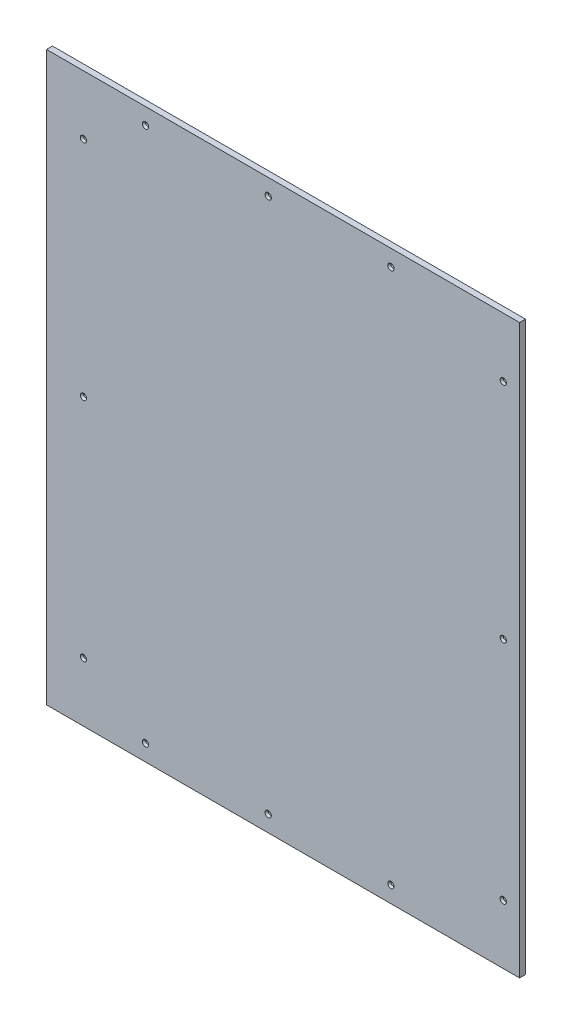
ISO-10303-21;
HEADER;
FILE_DESCRIPTION(('STEP AP214'),'2;1');
FILE_NAME('part.step','',(''),(''),'','','');
FILE_SCHEMA(('AUTOMOTIVE_DESIGN { 1 0 10303 214 1 1 1 1 }'));
ENDSEC;
DATA;
#1=APPLICATION_CONTEXT('core data for automotive mechanical design processes');
#2=APPLICATION_PROTOCOL_DEFINITION('international standard','automotive_design',2000,#1);
#3=PRODUCT_CONTEXT('',#1,'mechanical');
#4=PRODUCT('Part','Part','',(#3));
#5=PRODUCT_RELATED_PRODUCT_CATEGORY('part','',(#4));
#6=PRODUCT_DEFINITION_FORMATION('','',#4);
#7=PRODUCT_DEFINITION_CONTEXT('part definition',#1,'design');
#8=PRODUCT_DEFINITION('design','',#6,#7);
#9=PRODUCT_DEFINITION_SHAPE('','',#8);
#10=(LENGTH_UNIT() NAMED_UNIT(*) SI_UNIT(.MILLI.,.METRE.));
#11=(NAMED_UNIT(*) PLANE_ANGLE_UNIT() SI_UNIT($,.RADIAN.));
#12=(NAMED_UNIT(*) SI_UNIT($,.STERADIAN.) SOLID_ANGLE_UNIT());
#13=UNCERTAINTY_MEASURE_WITH_UNIT(LENGTH_MEASURE(1.E-05),#10,'distance_accuracy_value','');
#14=(GEOMETRIC_REPRESENTATION_CONTEXT(3) GLOBAL_UNCERTAINTY_ASSIGNED_CONTEXT((#13)) GLOBAL_UNIT_ASSIGNED_CONTEXT((#10,
#11,#12)) REPRESENTATION_CONTEXT('',''));
#15=CARTESIAN_POINT('',(0.,0.,0.));
#16=DIRECTION('',(0.,0.,1.));
#17=DIRECTION('',(1.,0.,0.));
#18=AXIS2_PLACEMENT_3D('',#15,#16,#17);
#19=CARTESIAN_POINT('',(0.,0.,12.7));
#20=DIRECTION('',(0.,0.,-1.));
#21=DIRECTION('',(-1.,0.,0.));
#22=AXIS2_PLACEMENT_3D('',#19,#20,#21);
#23=PLANE('',#22);
#24=CARTESIAN_POINT('',(-646.165814816772,1184.275,12.7));
#25=DIRECTION('',(0.,0.,1.));
#26=DIRECTION('',(1.,0.,0.));
#27=AXIS2_PLACEMENT_3D('',#24,#25,#26);
#28=CIRCLE('',#27,6.74370000000002);
#29=CARTESIAN_POINT('',(-639.422114816772,1184.275,12.7));
#30=VERTEX_POINT('',#29);
#31=EDGE_CURVE('E212',#30,#30,#28,.T.);
#32=ORIENTED_EDGE('',*,*,#31,.F.);
#33=EDGE_LOOP('',(#32));
#34=FACE_BOUND('',#33,.T.);
#35=CARTESIAN_POINT('',(-382.640814816772,1184.275,12.7));
#36=DIRECTION('',(0.,0.,1.));
#37=DIRECTION('',(1.,0.,0.));
#38=AXIS2_PLACEMENT_3D('',#35,#36,#37);
#39=CIRCLE('',#38,6.74370000000002);
#40=CARTESIAN_POINT('',(-375.897114816772,1184.275,12.7));
#41=VERTEX_POINT('',#40);
#42=EDGE_CURVE('E203',#41,#41,#39,.T.);
#43=ORIENTED_EDGE('',*,*,#42,.F.);
#44=EDGE_LOOP('',(#43));
#45=FACE_BOUND('',#44,.T.);
#46=CARTESIAN_POINT('',(-1042.91401418367,612.774999999999,12.7));
#47=DIRECTION('',(0.,0.,1.));
#48=DIRECTION('',(1.,0.,0.));
#49=AXIS2_PLACEMENT_3D('',#46,#47,#48);
#50=CIRCLE('',#49,6.74369999999991);
#51=CARTESIAN_POINT('',(-1036.17031418367,612.774999999999,12.7));
#52=VERTEX_POINT('',#51);
#53=EDGE_CURVE('E131',#52,#52,#50,.T.);
#54=ORIENTED_EDGE('',*,*,#53,.F.);
#55=EDGE_LOOP('',(#54));
#56=FACE_BOUND('',#55,.T.);
#57=DIRECTION('',(0.,1.,0.));
#58=VECTOR('',#57,1.);
#59=CARTESIAN_POINT('',(-106.288814816772,1219.2,12.7));
#60=LINE('',#59,#58);
#61=CARTESIAN_POINT('',(-106.288814816772,0.,12.7));
#62=VERTEX_POINT('',#61);
#63=CARTESIAN_POINT('',(-106.288814816772,1219.2,12.7));
#64=VERTEX_POINT('',#63);
#65=EDGE_CURVE('E90',#62,#64,#60,.T.);
#66=ORIENTED_EDGE('',*,*,#65,.T.);
#67=DIRECTION('',(-1.,0.,0.));
#68=VECTOR('',#67,1.);
#69=CARTESIAN_POINT('',(-106.288814816772,1219.2,12.7));
#70=LINE('',#69,#68);
#71=CARTESIAN_POINT('',(-1122.28881481677,1219.2,12.7));
#72=VERTEX_POINT('',#71);
#73=EDGE_CURVE('E85',#64,#72,#70,.T.);
#74=ORIENTED_EDGE('',*,*,#73,.T.);
#75=DIRECTION('',(0.,-1.,0.));
#76=VECTOR('',#75,1.);
#77=CARTESIAN_POINT('',(-1122.28881481677,1219.2,12.7));
#78=LINE('',#77,#76);
#79=CARTESIAN_POINT('',(-1122.28881481677,-2.22044604925031E-13,12.7));
#80=VERTEX_POINT('',#79);
#81=EDGE_CURVE('E88',#72,#80,#78,.T.);
#82=ORIENTED_EDGE('',*,*,#81,.T.);
#83=DIRECTION('',(1.,0.,0.));
#84=VECTOR('',#83,1.);
#85=CARTESIAN_POINT('',(-106.288814816772,0.,12.7));
#86=LINE('',#85,#84);
#87=EDGE_CURVE('E55',#80,#62,#86,.T.);
#88=ORIENTED_EDGE('',*,*,#87,.T.);
#89=EDGE_LOOP('',(#66,#74,#82,#88));
#90=FACE_BOUND('',#89,.T.);
#91=CARTESIAN_POINT('',(-1042.91401418367,1092.07299999998,12.7));
#92=DIRECTION('',(0.,0.,1.));
#93=DIRECTION('',(1.,0.,0.));
#94=AXIS2_PLACEMENT_3D('',#91,#92,#93);
#95=CIRCLE('',#94,6.74369999999991);
#96=CARTESIAN_POINT('',(-1036.17031418367,1092.07299999998,12.7));
#97=VERTEX_POINT('',#96);
#98=EDGE_CURVE('E122',#97,#97,#95,.T.);
#99=ORIENTED_EDGE('',*,*,#98,.F.);
#100=EDGE_LOOP('',(#99));
#101=FACE_BOUND('',#100,.T.);
#102=CARTESIAN_POINT('',(-1042.91401418364,126.999999999979,12.7));
#103=DIRECTION('',(0.,0.,1.));
#104=DIRECTION('',(1.,0.,0.));
#105=AXIS2_PLACEMENT_3D('',#102,#103,#104);
#106=CIRCLE('',#105,6.74369999999991);
#107=CARTESIAN_POINT('',(-1036.17031418364,126.999999999979,12.7));
#108=VERTEX_POINT('',#107);
#109=EDGE_CURVE('E140',#108,#108,#106,.T.);
#110=ORIENTED_EDGE('',*,*,#109,.F.);
#111=EDGE_LOOP('',(#110));
#112=FACE_BOUND('',#111,.T.);
#113=CARTESIAN_POINT('',(-909.690814816772,34.9249999999996,12.7));
#114=DIRECTION('',(0.,0.,1.));
#115=DIRECTION('',(1.,0.,0.));
#116=AXIS2_PLACEMENT_3D('',#113,#114,#115);
#117=CIRCLE('',#116,6.74370000000002);
#118=CARTESIAN_POINT('',(-902.947114816772,34.9249999999996,12.7));
#119=VERTEX_POINT('',#118);
#120=EDGE_CURVE('E149',#119,#119,#117,.T.);
#121=ORIENTED_EDGE('',*,*,#120,.F.);
#122=EDGE_LOOP('',(#121));
#123=FACE_BOUND('',#122,.T.);
#124=CARTESIAN_POINT('',(-646.165814816772,34.9249999999994,12.7));
#125=DIRECTION('',(0.,0.,1.));
#126=DIRECTION('',(1.,0.,0.));
#127=AXIS2_PLACEMENT_3D('',#124,#125,#126);
#128=CIRCLE('',#127,6.74370000000002);
#129=CARTESIAN_POINT('',(-639.422114816772,34.9249999999994,12.7));
#130=VERTEX_POINT('',#129);
#131=EDGE_CURVE('E158',#130,#130,#128,.T.);
#132=ORIENTED_EDGE('',*,*,#131,.F.);
#133=EDGE_LOOP('',(#132));
#134=FACE_BOUND('',#133,.T.);
#135=CARTESIAN_POINT('',(-382.640814816772,34.9249999999994,12.7));
#136=DIRECTION('',(0.,0.,1.));
#137=DIRECTION('',(1.,0.,0.));
#138=AXIS2_PLACEMENT_3D('',#135,#136,#137);
#139=CIRCLE('',#138,6.74370000000002);
#140=CARTESIAN_POINT('',(-375.897114816772,34.9249999999994,12.7));
#141=VERTEX_POINT('',#140);
#142=EDGE_CURVE('E167',#141,#141,#139,.T.);
#143=ORIENTED_EDGE('',*,*,#142,.F.);
#144=EDGE_LOOP('',(#143));
#145=FACE_BOUND('',#144,.T.);
#146=CARTESIAN_POINT('',(-141.213814816796,127.126999999999,12.7));
#147=DIRECTION('',(0.,0.,1.));
#148=DIRECTION('',(1.,0.,0.));
#149=AXIS2_PLACEMENT_3D('',#146,#147,#148);
#150=CIRCLE('',#149,6.74369999999999);
#151=CARTESIAN_POINT('',(-134.470114816796,127.126999999999,12.7));
#152=VERTEX_POINT('',#151);
#153=EDGE_CURVE('E176',#152,#152,#150,.T.);
#154=ORIENTED_EDGE('',*,*,#153,.F.);
#155=EDGE_LOOP('',(#154));
#156=FACE_BOUND('',#155,.T.);
#157=CARTESIAN_POINT('',(-141.213814816791,612.775,12.7));
#158=DIRECTION('',(0.,0.,1.));
#159=DIRECTION('',(1.,0.,0.));
#160=AXIS2_PLACEMENT_3D('',#157,#158,#159);
#161=CIRCLE('',#160,6.74369999999999);
#162=CARTESIAN_POINT('',(-134.470114816791,612.775,12.7));
#163=VERTEX_POINT('',#162);
#164=EDGE_CURVE('E185',#163,#163,#161,.T.);
#165=ORIENTED_EDGE('',*,*,#164,.F.);
#166=EDGE_LOOP('',(#165));
#167=FACE_BOUND('',#166,.T.);
#168=CARTESIAN_POINT('',(-141.213814816826,1092.073,12.7));
#169=DIRECTION('',(0.,0.,1.));
#170=DIRECTION('',(1.,0.,0.));
#171=AXIS2_PLACEMENT_3D('',#168,#169,#170);
#172=CIRCLE('',#171,6.74369999999999);
#173=CARTESIAN_POINT('',(-134.470114816826,1092.073,12.7));
#174=VERTEX_POINT('',#173);
#175=EDGE_CURVE('E194',#174,#174,#172,.T.);
#176=ORIENTED_EDGE('',*,*,#175,.F.);
#177=EDGE_LOOP('',(#176));
#178=FACE_BOUND('',#177,.T.);
#179=CARTESIAN_POINT('',(-909.690814816772,1184.275,12.7));
#180=DIRECTION('',(0.,0.,1.));
#181=DIRECTION('',(1.,0.,0.));
#182=AXIS2_PLACEMENT_3D('',#179,#180,#181);
#183=CIRCLE('',#182,6.74370000000002);
#184=CARTESIAN_POINT('',(-902.947114816772,1184.275,12.7));
#185=VERTEX_POINT('',#184);
#186=EDGE_CURVE('E221',#185,#185,#183,.T.);
#187=ORIENTED_EDGE('',*,*,#186,.F.);
#188=EDGE_LOOP('',(#187));
#189=FACE_BOUND('',#188,.T.);
#190=ADVANCED_FACE('F38',(#34,#45,#56,#90,#101,#112,#123,#134,#145,#156,#167,#178,#189),#23,.F.);
#191=CARTESIAN_POINT('',(0.,0.,0.));
#192=DIRECTION('',(0.,0.,-1.));
#193=DIRECTION('',(-1.,0.,0.));
#194=AXIS2_PLACEMENT_3D('',#191,#192,#193);
#195=PLANE('',#194);
#196=CARTESIAN_POINT('',(-646.165814816772,1184.275,0.));
#197=DIRECTION('',(0.,0.,1.));
#198=DIRECTION('',(1.,0.,0.));
#199=AXIS2_PLACEMENT_3D('',#196,#197,#198);
#200=CIRCLE('',#199,3.3782);
#201=CARTESIAN_POINT('',(-642.787614816772,1184.275,0.));
#202=VERTEX_POINT('',#201);
#203=EDGE_CURVE('E206',#202,#202,#200,.T.);
#204=ORIENTED_EDGE('',*,*,#203,.T.);
#205=EDGE_LOOP('',(#204));
#206=FACE_BOUND('',#205,.T.);
#207=CARTESIAN_POINT('',(-141.213814816826,1092.073,0.));
#208=DIRECTION('',(0.,0.,1.));
#209=DIRECTION('',(1.,0.,0.));
#210=AXIS2_PLACEMENT_3D('',#207,#208,#209);
#211=CIRCLE('',#210,3.3782);
#212=CARTESIAN_POINT('',(-137.835614816826,1092.073,0.));
#213=VERTEX_POINT('',#212);
#214=EDGE_CURVE('E188',#213,#213,#211,.T.);
#215=ORIENTED_EDGE('',*,*,#214,.T.);
#216=EDGE_LOOP('',(#215));
#217=FACE_BOUND('',#216,.T.);
#218=CARTESIAN_POINT('',(-141.213814816796,127.126999999999,0.));
#219=DIRECTION('',(0.,0.,1.));
#220=DIRECTION('',(1.,0.,0.));
#221=AXIS2_PLACEMENT_3D('',#218,#219,#220);
#222=CIRCLE('',#221,3.3782);
#223=CARTESIAN_POINT('',(-137.835614816796,127.126999999999,0.));
#224=VERTEX_POINT('',#223);
#225=EDGE_CURVE('E170',#224,#224,#222,.T.);
#226=ORIENTED_EDGE('',*,*,#225,.T.);
#227=EDGE_LOOP('',(#226));
#228=FACE_BOUND('',#227,.T.);
#229=CARTESIAN_POINT('',(-382.640814816772,34.9249999999994,0.));
#230=DIRECTION('',(0.,0.,1.));
#231=DIRECTION('',(1.,0.,0.));
#232=AXIS2_PLACEMENT_3D('',#229,#230,#231);
#233=CIRCLE('',#232,3.3782);
#234=CARTESIAN_POINT('',(-379.262614816772,34.9249999999994,0.));
#235=VERTEX_POINT('',#234);
#236=EDGE_CURVE('E161',#235,#235,#233,.T.);
#237=ORIENTED_EDGE('',*,*,#236,.T.);
#238=EDGE_LOOP('',(#237));
#239=FACE_BOUND('',#238,.T.);
#240=CARTESIAN_POINT('',(-646.165814816772,34.9249999999994,0.));
#241=DIRECTION('',(0.,0.,1.));
#242=DIRECTION('',(1.,0.,0.));
#243=AXIS2_PLACEMENT_3D('',#240,#241,#242);
#244=CIRCLE('',#243,3.3782);
#245=CARTESIAN_POINT('',(-642.787614816772,34.9249999999994,0.));
#246=VERTEX_POINT('',#245);
#247=EDGE_CURVE('E152',#246,#246,#244,.T.);
#248=ORIENTED_EDGE('',*,*,#247,.T.);
#249=EDGE_LOOP('',(#248));
#250=FACE_BOUND('',#249,.T.);
#251=CARTESIAN_POINT('',(-909.690814816772,34.9249999999996,0.));
#252=DIRECTION('',(0.,0.,1.));
#253=DIRECTION('',(1.,0.,0.));
#254=AXIS2_PLACEMENT_3D('',#251,#252,#253);
#255=CIRCLE('',#254,3.3782);
#256=CARTESIAN_POINT('',(-906.312614816772,34.9249999999996,0.));
#257=VERTEX_POINT('',#256);
#258=EDGE_CURVE('E143',#257,#257,#255,.T.);
#259=ORIENTED_EDGE('',*,*,#258,.T.);
#260=EDGE_LOOP('',(#259));
#261=FACE_BOUND('',#260,.T.);
#262=CARTESIAN_POINT('',(-1042.91401418367,1092.07299999998,0.));
#263=DIRECTION('',(0.,0.,1.));
#264=DIRECTION('',(1.,0.,0.));
#265=AXIS2_PLACEMENT_3D('',#262,#263,#264);
#266=CIRCLE('',#265,3.3782);
#267=CARTESIAN_POINT('',(-1039.53581418367,1092.07299999998,0.));
#268=VERTEX_POINT('',#267);
#269=EDGE_CURVE('E105',#268,#268,#266,.T.);
#270=ORIENTED_EDGE('',*,*,#269,.T.);
#271=EDGE_LOOP('',(#270));
#272=FACE_BOUND('',#271,.T.);
#273=DIRECTION('',(0.,1.,0.));
#274=VECTOR('',#273,1.);
#275=CARTESIAN_POINT('',(-106.288814816772,1219.2,0.));
#276=LINE('',#275,#274);
#277=CARTESIAN_POINT('',(-106.288814816772,0.,0.));
#278=VERTEX_POINT('',#277);
#279=CARTESIAN_POINT('',(-106.288814816772,1219.2,0.));
#280=VERTEX_POINT('',#279);
#281=EDGE_CURVE('E102',#278,#280,#276,.T.);
#282=ORIENTED_EDGE('',*,*,#281,.F.);
#283=DIRECTION('',(1.,0.,0.));
#284=VECTOR('',#283,1.);
#285=CARTESIAN_POINT('',(-106.288814816772,0.,0.));
#286=LINE('',#285,#284);
#287=CARTESIAN_POINT('',(-1122.28881481677,-2.22044604925031E-13,0.));
#288=VERTEX_POINT('',#287);
#289=EDGE_CURVE('E78',#288,#278,#286,.T.);
#290=ORIENTED_EDGE('',*,*,#289,.F.);
#291=DIRECTION('',(0.,-1.,0.));
#292=VECTOR('',#291,1.);
#293=CARTESIAN_POINT('',(-1122.28881481677,1219.2,0.));
#294=LINE('',#293,#292);
#295=CARTESIAN_POINT('',(-1122.28881481677,1219.2,0.));
#296=VERTEX_POINT('',#295);
#297=EDGE_CURVE('E72',#296,#288,#294,.T.);
#298=ORIENTED_EDGE('',*,*,#297,.F.);
#299=DIRECTION('',(-1.,0.,0.));
#300=VECTOR('',#299,1.);
#301=CARTESIAN_POINT('',(-106.288814816772,1219.2,0.));
#302=LINE('',#301,#300);
#303=EDGE_CURVE('E94',#280,#296,#302,.T.);
#304=ORIENTED_EDGE('',*,*,#303,.F.);
#305=EDGE_LOOP('',(#282,#290,#298,#304));
#306=FACE_BOUND('',#305,.T.);
#307=CARTESIAN_POINT('',(-1042.91401418367,612.774999999999,0.));
#308=DIRECTION('',(0.,0.,1.));
#309=DIRECTION('',(1.,0.,0.));
#310=AXIS2_PLACEMENT_3D('',#307,#308,#309);
#311=CIRCLE('',#310,3.3782);
#312=CARTESIAN_POINT('',(-1039.53581418367,612.774999999999,0.));
#313=VERTEX_POINT('',#312);
#314=EDGE_CURVE('E125',#313,#313,#311,.T.);
#315=ORIENTED_EDGE('',*,*,#314,.T.);
#316=EDGE_LOOP('',(#315));
#317=FACE_BOUND('',#316,.T.);
#318=CARTESIAN_POINT('',(-1042.91401418364,126.999999999979,0.));
#319=DIRECTION('',(0.,0.,1.));
#320=DIRECTION('',(1.,0.,0.));
#321=AXIS2_PLACEMENT_3D('',#318,#319,#320);
#322=CIRCLE('',#321,3.3782);
#323=CARTESIAN_POINT('',(-1039.53581418364,126.999999999979,0.));
#324=VERTEX_POINT('',#323);
#325=EDGE_CURVE('E134',#324,#324,#322,.T.);
#326=ORIENTED_EDGE('',*,*,#325,.T.);
#327=EDGE_LOOP('',(#326));
#328=FACE_BOUND('',#327,.T.);
#329=CARTESIAN_POINT('',(-141.213814816791,612.775,0.));
#330=DIRECTION('',(0.,0.,1.));
#331=DIRECTION('',(1.,0.,0.));
#332=AXIS2_PLACEMENT_3D('',#329,#330,#331);
#333=CIRCLE('',#332,3.3782);
#334=CARTESIAN_POINT('',(-137.835614816791,612.775,0.));
#335=VERTEX_POINT('',#334);
#336=EDGE_CURVE('E179',#335,#335,#333,.T.);
#337=ORIENTED_EDGE('',*,*,#336,.T.);
#338=EDGE_LOOP('',(#337));
#339=FACE_BOUND('',#338,.T.);
#340=CARTESIAN_POINT('',(-382.640814816772,1184.275,0.));
#341=DIRECTION('',(0.,0.,1.));
#342=DIRECTION('',(1.,0.,0.));
#343=AXIS2_PLACEMENT_3D('',#340,#341,#342);
#344=CIRCLE('',#343,3.3782);
#345=CARTESIAN_POINT('',(-379.262614816772,1184.275,0.));
#346=VERTEX_POINT('',#345);
#347=EDGE_CURVE('E197',#346,#346,#344,.T.);
#348=ORIENTED_EDGE('',*,*,#347,.T.);
#349=EDGE_LOOP('',(#348));
#350=FACE_BOUND('',#349,.T.);
#351=CARTESIAN_POINT('',(-909.690814816772,1184.275,0.));
#352=DIRECTION('',(0.,0.,1.));
#353=DIRECTION('',(1.,0.,0.));
#354=AXIS2_PLACEMENT_3D('',#351,#352,#353);
#355=CIRCLE('',#354,3.3782);
#356=CARTESIAN_POINT('',(-906.312614816772,1184.275,0.));
#357=VERTEX_POINT('',#356);
#358=EDGE_CURVE('E215',#357,#357,#355,.T.);
#359=ORIENTED_EDGE('',*,*,#358,.T.);
#360=EDGE_LOOP('',(#359));
#361=FACE_BOUND('',#360,.T.);
#362=ADVANCED_FACE('F113',(#206,#217,#228,#239,#250,#261,#272,#306,#317,#328,#339,#350,#361),
#195,.T.);
#363=CARTESIAN_POINT('',(-106.288814816772,1219.2,12.7));
#364=DIRECTION('',(-1.,0.,0.));
#365=DIRECTION('',(0.,0.,1.));
#366=AXIS2_PLACEMENT_3D('',#363,#364,#365);
#367=PLANE('',#366);
#368=ORIENTED_EDGE('',*,*,#281,.T.);
#369=DIRECTION('',(0.,0.,-1.));
#370=VECTOR('',#369,1.);
#371=CARTESIAN_POINT('',(-106.288814816772,1219.2,12.7));
#372=LINE('',#371,#370);
#373=EDGE_CURVE('E11',#64,#280,#372,.T.);
#374=ORIENTED_EDGE('',*,*,#373,.F.);
#375=ORIENTED_EDGE('',*,*,#65,.F.);
#376=DIRECTION('',(0.,0.,-1.));
#377=VECTOR('',#376,1.);
#378=CARTESIAN_POINT('',(-106.288814816772,0.,12.7));
#379=LINE('',#378,#377);
#380=EDGE_CURVE('E98',#62,#278,#379,.T.);
#381=ORIENTED_EDGE('',*,*,#380,.T.);
#382=EDGE_LOOP('',(#368,#374,#375,#381));
#383=FACE_BOUND('',#382,.T.);
#384=ADVANCED_FACE('F40',(#383),#367,.F.);
#385=CARTESIAN_POINT('',(-106.288814816772,1219.2,12.7));
#386=DIRECTION('',(0.,-1.,0.));
#387=DIRECTION('',(1.,0.,0.));
#388=AXIS2_PLACEMENT_3D('',#385,#386,#387);
#389=PLANE('',#388);
#390=ORIENTED_EDGE('',*,*,#303,.T.);
#391=DIRECTION('',(0.,0.,-1.));
#392=VECTOR('',#391,1.);
#393=CARTESIAN_POINT('',(-1122.28881481677,1219.2,12.7));
#394=LINE('',#393,#392);
#395=EDGE_CURVE('E47',#72,#296,#394,.T.);
#396=ORIENTED_EDGE('',*,*,#395,.F.);
#397=ORIENTED_EDGE('',*,*,#73,.F.);
#398=ORIENTED_EDGE('',*,*,#373,.T.);
#399=EDGE_LOOP('',(#390,#396,#397,#398));
#400=FACE_BOUND('',#399,.T.);
#401=ADVANCED_FACE('F93',(#400),#389,.F.);
#402=CARTESIAN_POINT('',(-1122.28881481677,1219.2,12.7));
#403=DIRECTION('',(1.,0.,0.));
#404=DIRECTION('',(0.,1.,0.));
#405=AXIS2_PLACEMENT_3D('',#402,#403,#404);
#406=PLANE('',#405);
#407=ORIENTED_EDGE('',*,*,#297,.T.);
#408=DIRECTION('',(0.,0.,-1.));
#409=VECTOR('',#408,1.);
#410=CARTESIAN_POINT('',(-1122.28881481677,-2.22044604925031E-13,12.7));
#411=LINE('',#410,#409);
#412=EDGE_CURVE('E95',#80,#288,#411,.T.);
#413=ORIENTED_EDGE('',*,*,#412,.F.);
#414=ORIENTED_EDGE('',*,*,#81,.F.);
#415=ORIENTED_EDGE('',*,*,#395,.T.);
#416=EDGE_LOOP('',(#407,#413,#414,#415));
#417=FACE_BOUND('',#416,.T.);
#418=ADVANCED_FACE('F96',(#417),#406,.F.);
#419=CARTESIAN_POINT('',(-106.288814816772,0.,12.7));
#420=DIRECTION('',(0.,1.,0.));
#421=DIRECTION('',(-1.,0.,0.));
#422=AXIS2_PLACEMENT_3D('',#419,#420,#421);
#423=PLANE('',#422);
#424=ORIENTED_EDGE('',*,*,#289,.T.);
#425=ORIENTED_EDGE('',*,*,#380,.F.);
#426=ORIENTED_EDGE('',*,*,#87,.F.);
#427=ORIENTED_EDGE('',*,*,#412,.T.);
#428=EDGE_LOOP('',(#424,#425,#426,#427));
#429=FACE_BOUND('',#428,.T.);
#430=ADVANCED_FACE('F110',(#429),#423,.F.);
#431=CARTESIAN_POINT('',(-1042.91401418367,1092.07299999998,12.7));
#432=DIRECTION('',(0.,0.,1.));
#433=DIRECTION('',(1.,0.,0.));
#434=AXIS2_PLACEMENT_3D('',#431,#432,#433);
#435=CYLINDRICAL_SURFACE('',#434,3.3782);
#436=ORIENTED_EDGE('',*,*,#269,.F.);
#437=EDGE_LOOP('',(#436));
#438=FACE_BOUND('',#437,.T.);
#439=CARTESIAN_POINT('',(-1042.91401418367,1092.07299999998,8.82843512549769));
#440=DIRECTION('',(0.,0.,1.));
#441=DIRECTION('',(1.,0.,0.));
#442=AXIS2_PLACEMENT_3D('',#439,#440,#441);
#443=CIRCLE('',#442,3.3782);
#444=CARTESIAN_POINT('',(-1039.53581418367,1092.07299999998,8.82843512549769));
#445=VERTEX_POINT('',#444);
#446=EDGE_CURVE('E119',#445,#445,#443,.T.);
#447=ORIENTED_EDGE('',*,*,#446,.T.);
#448=EDGE_LOOP('',(#447));
#449=FACE_BOUND('',#448,.T.);
#450=ADVANCED_FACE('F238',(#438,#449),#435,.F.);
#451=CARTESIAN_POINT('',(-1042.91401418367,1092.07299999998,12.7));
#452=DIRECTION('',(0.,0.,1.));
#453=DIRECTION('',(1.,0.,0.));
#454=AXIS2_PLACEMENT_3D('',#451,#452,#453);
#455=CONICAL_SURFACE('',#454,6.74369999999991,0.715584993317662);
#456=ORIENTED_EDGE('',*,*,#446,.F.);
#457=EDGE_LOOP('',(#456));
#458=FACE_BOUND('',#457,.T.);
#459=ORIENTED_EDGE('',*,*,#98,.T.);
#460=EDGE_LOOP('',(#459));
#461=FACE_BOUND('',#460,.T.);
#462=ADVANCED_FACE('F268',(#458,#461),#455,.F.);
#463=CARTESIAN_POINT('',(-1042.91401418367,612.774999999999,12.7));
#464=DIRECTION('',(0.,0.,1.));
#465=DIRECTION('',(1.,0.,0.));
#466=AXIS2_PLACEMENT_3D('',#463,#464,#465);
#467=CYLINDRICAL_SURFACE('',#466,3.3782);
#468=ORIENTED_EDGE('',*,*,#314,.F.);
#469=EDGE_LOOP('',(#468));
#470=FACE_BOUND('',#469,.T.);
#471=CARTESIAN_POINT('',(-1042.91401418367,612.774999999999,8.82843512549769));
#472=DIRECTION('',(0.,0.,1.));
#473=DIRECTION('',(1.,0.,0.));
#474=AXIS2_PLACEMENT_3D('',#471,#472,#473);
#475=CIRCLE('',#474,3.3782);
#476=CARTESIAN_POINT('',(-1039.53581418367,612.774999999999,8.82843512549769));
#477=VERTEX_POINT('',#476);
#478=EDGE_CURVE('E128',#477,#477,#475,.T.);
#479=ORIENTED_EDGE('',*,*,#478,.T.);
#480=EDGE_LOOP('',(#479));
#481=FACE_BOUND('',#480,.T.);
#482=ADVANCED_FACE('F277',(#470,#481),#467,.F.);
#483=CARTESIAN_POINT('',(-1042.91401418367,612.774999999999,12.7));
#484=DIRECTION('',(0.,0.,1.));
#485=DIRECTION('',(1.,0.,0.));
#486=AXIS2_PLACEMENT_3D('',#483,#484,#485);
#487=CONICAL_SURFACE('',#486,6.74369999999991,0.715584993317662);
#488=ORIENTED_EDGE('',*,*,#478,.F.);
#489=EDGE_LOOP('',(#488));
#490=FACE_BOUND('',#489,.T.);
#491=ORIENTED_EDGE('',*,*,#53,.T.);
#492=EDGE_LOOP('',(#491));
#493=FACE_BOUND('',#492,.T.);
#494=ADVANCED_FACE('F286',(#490,#493),#487,.F.);
#495=CARTESIAN_POINT('',(-1042.91401418364,126.999999999979,12.7));
#496=DIRECTION('',(0.,0.,1.));
#497=DIRECTION('',(1.,0.,0.));
#498=AXIS2_PLACEMENT_3D('',#495,#496,#497);
#499=CYLINDRICAL_SURFACE('',#498,3.3782);
#500=ORIENTED_EDGE('',*,*,#325,.F.);
#501=EDGE_LOOP('',(#500));
#502=FACE_BOUND('',#501,.T.);
#503=CARTESIAN_POINT('',(-1042.91401418364,126.999999999979,8.82843512549769));
#504=DIRECTION('',(0.,0.,1.));
#505=DIRECTION('',(1.,0.,0.));
#506=AXIS2_PLACEMENT_3D('',#503,#504,#505);
#507=CIRCLE('',#506,3.3782);
#508=CARTESIAN_POINT('',(-1039.53581418364,126.999999999979,8.82843512549769));
#509=VERTEX_POINT('',#508);
#510=EDGE_CURVE('E137',#509,#509,#507,.T.);
#511=ORIENTED_EDGE('',*,*,#510,.T.);
#512=EDGE_LOOP('',(#511));
#513=FACE_BOUND('',#512,.T.);
#514=ADVANCED_FACE('F296',(#502,#513),#499,.F.);
#515=CARTESIAN_POINT('',(-1042.91401418364,126.999999999979,12.7));
#516=DIRECTION('',(0.,0.,1.));
#517=DIRECTION('',(1.,0.,0.));
#518=AXIS2_PLACEMENT_3D('',#515,#516,#517);
#519=CONICAL_SURFACE('',#518,6.74369999999991,0.715584993317662);
#520=ORIENTED_EDGE('',*,*,#510,.F.);
#521=EDGE_LOOP('',(#520));
#522=FACE_BOUND('',#521,.T.);
#523=ORIENTED_EDGE('',*,*,#109,.T.);
#524=EDGE_LOOP('',(#523));
#525=FACE_BOUND('',#524,.T.);
#526=ADVANCED_FACE('F306',(#522,#525),#519,.F.);
#527=CARTESIAN_POINT('',(-909.690814816772,34.9249999999996,12.7));
#528=DIRECTION('',(0.,0.,1.));
#529=DIRECTION('',(1.,0.,0.));
#530=AXIS2_PLACEMENT_3D('',#527,#528,#529);
#531=CYLINDRICAL_SURFACE('',#530,3.3782);
#532=ORIENTED_EDGE('',*,*,#258,.F.);
#533=EDGE_LOOP('',(#532));
#534=FACE_BOUND('',#533,.T.);
#535=CARTESIAN_POINT('',(-909.690814816772,34.9249999999996,8.82843512549769));
#536=DIRECTION('',(0.,0.,1.));
#537=DIRECTION('',(1.,0.,0.));
#538=AXIS2_PLACEMENT_3D('',#535,#536,#537);
#539=CIRCLE('',#538,3.3782);
#540=CARTESIAN_POINT('',(-906.312614816772,34.9249999999996,8.82843512549769));
#541=VERTEX_POINT('',#540);
#542=EDGE_CURVE('E146',#541,#541,#539,.T.);
#543=ORIENTED_EDGE('',*,*,#542,.T.);
#544=EDGE_LOOP('',(#543));
#545=FACE_BOUND('',#544,.T.);
#546=ADVANCED_FACE('F316',(#534,#545),#531,.F.);
#547=CARTESIAN_POINT('',(-909.690814816772,34.9249999999996,12.7));
#548=DIRECTION('',(0.,0.,1.));
#549=DIRECTION('',(1.,0.,0.));
#550=AXIS2_PLACEMENT_3D('',#547,#548,#549);
#551=CONICAL_SURFACE('',#550,6.74370000000002,0.715584993317678);
#552=ORIENTED_EDGE('',*,*,#542,.F.);
#553=EDGE_LOOP('',(#552));
#554=FACE_BOUND('',#553,.T.);
#555=ORIENTED_EDGE('',*,*,#120,.T.);
#556=EDGE_LOOP('',(#555));
#557=FACE_BOUND('',#556,.T.);
#558=ADVANCED_FACE('F326',(#554,#557),#551,.F.);
#559=CARTESIAN_POINT('',(-646.165814816772,34.9249999999994,12.7));
#560=DIRECTION('',(0.,0.,1.));
#561=DIRECTION('',(1.,0.,0.));
#562=AXIS2_PLACEMENT_3D('',#559,#560,#561);
#563=CYLINDRICAL_SURFACE('',#562,3.3782);
#564=ORIENTED_EDGE('',*,*,#247,.F.);
#565=EDGE_LOOP('',(#564));
#566=FACE_BOUND('',#565,.T.);
#567=CARTESIAN_POINT('',(-646.165814816772,34.9249999999994,8.82843512549769));
#568=DIRECTION('',(0.,0.,1.));
#569=DIRECTION('',(1.,0.,0.));
#570=AXIS2_PLACEMENT_3D('',#567,#568,#569);
#571=CIRCLE('',#570,3.3782);
#572=CARTESIAN_POINT('',(-642.787614816772,34.9249999999994,8.82843512549769));
#573=VERTEX_POINT('',#572);
#574=EDGE_CURVE('E155',#573,#573,#571,.T.);
#575=ORIENTED_EDGE('',*,*,#574,.T.);
#576=EDGE_LOOP('',(#575));
#577=FACE_BOUND('',#576,.T.);
#578=ADVANCED_FACE('F336',(#566,#577),#563,.F.);
#579=CARTESIAN_POINT('',(-646.165814816772,34.9249999999994,12.7));
#580=DIRECTION('',(0.,0.,1.));
#581=DIRECTION('',(1.,0.,0.));
#582=AXIS2_PLACEMENT_3D('',#579,#580,#581);
#583=CONICAL_SURFACE('',#582,6.74370000000002,0.715584993317678);
#584=ORIENTED_EDGE('',*,*,#574,.F.);
#585=EDGE_LOOP('',(#584));
#586=FACE_BOUND('',#585,.T.);
#587=ORIENTED_EDGE('',*,*,#131,.T.);
#588=EDGE_LOOP('',(#587));
#589=FACE_BOUND('',#588,.T.);
#590=ADVANCED_FACE('F346',(#586,#589),#583,.F.);
#591=CARTESIAN_POINT('',(-382.640814816772,34.9249999999994,12.7));
#592=DIRECTION('',(0.,0.,1.));
#593=DIRECTION('',(1.,0.,0.));
#594=AXIS2_PLACEMENT_3D('',#591,#592,#593);
#595=CYLINDRICAL_SURFACE('',#594,3.3782);
#596=ORIENTED_EDGE('',*,*,#236,.F.);
#597=EDGE_LOOP('',(#596));
#598=FACE_BOUND('',#597,.T.);
#599=CARTESIAN_POINT('',(-382.640814816772,34.9249999999994,8.82843512549769));
#600=DIRECTION('',(0.,0.,1.));
#601=DIRECTION('',(1.,0.,0.));
#602=AXIS2_PLACEMENT_3D('',#599,#600,#601);
#603=CIRCLE('',#602,3.3782);
#604=CARTESIAN_POINT('',(-379.262614816772,34.9249999999994,8.82843512549769));
#605=VERTEX_POINT('',#604);
#606=EDGE_CURVE('E164',#605,#605,#603,.T.);
#607=ORIENTED_EDGE('',*,*,#606,.T.);
#608=EDGE_LOOP('',(#607));
#609=FACE_BOUND('',#608,.T.);
#610=ADVANCED_FACE('F356',(#598,#609),#595,.F.);
#611=CARTESIAN_POINT('',(-382.640814816772,34.9249999999994,12.7));
#612=DIRECTION('',(0.,0.,1.));
#613=DIRECTION('',(1.,0.,0.));
#614=AXIS2_PLACEMENT_3D('',#611,#612,#613);
#615=CONICAL_SURFACE('',#614,6.74370000000002,0.715584993317678);
#616=ORIENTED_EDGE('',*,*,#606,.F.);
#617=EDGE_LOOP('',(#616));
#618=FACE_BOUND('',#617,.T.);
#619=ORIENTED_EDGE('',*,*,#142,.T.);
#620=EDGE_LOOP('',(#619));
#621=FACE_BOUND('',#620,.T.);
#622=ADVANCED_FACE('F366',(#618,#621),#615,.F.);
#623=CARTESIAN_POINT('',(-141.213814816796,127.126999999999,12.7));
#624=DIRECTION('',(0.,0.,1.));
#625=DIRECTION('',(1.,0.,0.));
#626=AXIS2_PLACEMENT_3D('',#623,#624,#625);
#627=CYLINDRICAL_SURFACE('',#626,3.3782);
#628=ORIENTED_EDGE('',*,*,#225,.F.);
#629=EDGE_LOOP('',(#628));
#630=FACE_BOUND('',#629,.T.);
#631=CARTESIAN_POINT('',(-141.213814816796,127.126999999999,8.82843512549769));
#632=DIRECTION('',(0.,0.,1.));
#633=DIRECTION('',(1.,0.,0.));
#634=AXIS2_PLACEMENT_3D('',#631,#632,#633);
#635=CIRCLE('',#634,3.3782);
#636=CARTESIAN_POINT('',(-137.835614816796,127.126999999999,8.82843512549769));
#637=VERTEX_POINT('',#636);
#638=EDGE_CURVE('E173',#637,#637,#635,.T.);
#639=ORIENTED_EDGE('',*,*,#638,.T.);
#640=EDGE_LOOP('',(#639));
#641=FACE_BOUND('',#640,.T.);
#642=ADVANCED_FACE('F376',(#630,#641),#627,.F.);
#643=CARTESIAN_POINT('',(-141.213814816796,127.126999999999,12.7));
#644=DIRECTION('',(0.,0.,1.));
#645=DIRECTION('',(1.,0.,0.));
#646=AXIS2_PLACEMENT_3D('',#643,#644,#645);
#647=CONICAL_SURFACE('',#646,6.74369999999999,0.715584993317674);
#648=ORIENTED_EDGE('',*,*,#638,.F.);
#649=EDGE_LOOP('',(#648));
#650=FACE_BOUND('',#649,.T.);
#651=ORIENTED_EDGE('',*,*,#153,.T.);
#652=EDGE_LOOP('',(#651));
#653=FACE_BOUND('',#652,.T.);
#654=ADVANCED_FACE('F386',(#650,#653),#647,.F.);
#655=CARTESIAN_POINT('',(-141.213814816791,612.775,12.7));
#656=DIRECTION('',(0.,0.,1.));
#657=DIRECTION('',(1.,0.,0.));
#658=AXIS2_PLACEMENT_3D('',#655,#656,#657);
#659=CYLINDRICAL_SURFACE('',#658,3.3782);
#660=ORIENTED_EDGE('',*,*,#336,.F.);
#661=EDGE_LOOP('',(#660));
#662=FACE_BOUND('',#661,.T.);
#663=CARTESIAN_POINT('',(-141.213814816791,612.775,8.82843512549769));
#664=DIRECTION('',(0.,0.,1.));
#665=DIRECTION('',(1.,0.,0.));
#666=AXIS2_PLACEMENT_3D('',#663,#664,#665);
#667=CIRCLE('',#666,3.3782);
#668=CARTESIAN_POINT('',(-137.835614816791,612.775,8.82843512549769));
#669=VERTEX_POINT('',#668);
#670=EDGE_CURVE('E182',#669,#669,#667,.T.);
#671=ORIENTED_EDGE('',*,*,#670,.T.);
#672=EDGE_LOOP('',(#671));
#673=FACE_BOUND('',#672,.T.);
#674=ADVANCED_FACE('F396',(#662,#673),#659,.F.);
#675=CARTESIAN_POINT('',(-141.213814816791,612.775,12.7));
#676=DIRECTION('',(0.,0.,1.));
#677=DIRECTION('',(1.,0.,0.));
#678=AXIS2_PLACEMENT_3D('',#675,#676,#677);
#679=CONICAL_SURFACE('',#678,6.74369999999999,0.715584993317674);
#680=ORIENTED_EDGE('',*,*,#670,.F.);
#681=EDGE_LOOP('',(#680));
#682=FACE_BOUND('',#681,.T.);
#683=ORIENTED_EDGE('',*,*,#164,.T.);
#684=EDGE_LOOP('',(#683));
#685=FACE_BOUND('',#684,.T.);
#686=ADVANCED_FACE('F406',(#682,#685),#679,.F.);
#687=CARTESIAN_POINT('',(-141.213814816826,1092.073,12.7));
#688=DIRECTION('',(0.,0.,1.));
#689=DIRECTION('',(1.,0.,0.));
#690=AXIS2_PLACEMENT_3D('',#687,#688,#689);
#691=CYLINDRICAL_SURFACE('',#690,3.3782);
#692=ORIENTED_EDGE('',*,*,#214,.F.);
#693=EDGE_LOOP('',(#692));
#694=FACE_BOUND('',#693,.T.);
#695=CARTESIAN_POINT('',(-141.213814816826,1092.073,8.82843512549769));
#696=DIRECTION('',(0.,0.,1.));
#697=DIRECTION('',(1.,0.,0.));
#698=AXIS2_PLACEMENT_3D('',#695,#696,#697);
#699=CIRCLE('',#698,3.3782);
#700=CARTESIAN_POINT('',(-137.835614816826,1092.073,8.82843512549769));
#701=VERTEX_POINT('',#700);
#702=EDGE_CURVE('E191',#701,#701,#699,.T.);
#703=ORIENTED_EDGE('',*,*,#702,.T.);
#704=EDGE_LOOP('',(#703));
#705=FACE_BOUND('',#704,.T.);
#706=ADVANCED_FACE('F416',(#694,#705),#691,.F.);
#707=CARTESIAN_POINT('',(-141.213814816826,1092.073,12.7));
#708=DIRECTION('',(0.,0.,1.));
#709=DIRECTION('',(1.,0.,0.));
#710=AXIS2_PLACEMENT_3D('',#707,#708,#709);
#711=CONICAL_SURFACE('',#710,6.74369999999999,0.715584993317674);
#712=ORIENTED_EDGE('',*,*,#702,.F.);
#713=EDGE_LOOP('',(#712));
#714=FACE_BOUND('',#713,.T.);
#715=ORIENTED_EDGE('',*,*,#175,.T.);
#716=EDGE_LOOP('',(#715));
#717=FACE_BOUND('',#716,.T.);
#718=ADVANCED_FACE('F426',(#714,#717),#711,.F.);
#719=CARTESIAN_POINT('',(-382.640814816772,1184.275,12.7));
#720=DIRECTION('',(0.,0.,1.));
#721=DIRECTION('',(1.,0.,0.));
#722=AXIS2_PLACEMENT_3D('',#719,#720,#721);
#723=CYLINDRICAL_SURFACE('',#722,3.3782);
#724=ORIENTED_EDGE('',*,*,#347,.F.);
#725=EDGE_LOOP('',(#724));
#726=FACE_BOUND('',#725,.T.);
#727=CARTESIAN_POINT('',(-382.640814816772,1184.275,8.82843512549769));
#728=DIRECTION('',(0.,0.,1.));
#729=DIRECTION('',(1.,0.,0.));
#730=AXIS2_PLACEMENT_3D('',#727,#728,#729);
#731=CIRCLE('',#730,3.3782);
#732=CARTESIAN_POINT('',(-379.262614816772,1184.275,8.82843512549769));
#733=VERTEX_POINT('',#732);
#734=EDGE_CURVE('E200',#733,#733,#731,.T.);
#735=ORIENTED_EDGE('',*,*,#734,.T.);
#736=EDGE_LOOP('',(#735));
#737=FACE_BOUND('',#736,.T.);
#738=ADVANCED_FACE('F436',(#726,#737),#723,.F.);
#739=CARTESIAN_POINT('',(-382.640814816772,1184.275,12.7));
#740=DIRECTION('',(0.,0.,1.));
#741=DIRECTION('',(1.,0.,0.));
#742=AXIS2_PLACEMENT_3D('',#739,#740,#741);
#743=CONICAL_SURFACE('',#742,6.74370000000002,0.715584993317678);
#744=ORIENTED_EDGE('',*,*,#734,.F.);
#745=EDGE_LOOP('',(#744));
#746=FACE_BOUND('',#745,.T.);
#747=ORIENTED_EDGE('',*,*,#42,.T.);
#748=EDGE_LOOP('',(#747));
#749=FACE_BOUND('',#748,.T.);
#750=ADVANCED_FACE('F446',(#746,#749),#743,.F.);
#751=CARTESIAN_POINT('',(-646.165814816772,1184.275,12.7));
#752=DIRECTION('',(0.,0.,1.));
#753=DIRECTION('',(1.,0.,0.));
#754=AXIS2_PLACEMENT_3D('',#751,#752,#753);
#755=CYLINDRICAL_SURFACE('',#754,3.3782);
#756=ORIENTED_EDGE('',*,*,#203,.F.);
#757=EDGE_LOOP('',(#756));
#758=FACE_BOUND('',#757,.T.);
#759=CARTESIAN_POINT('',(-646.165814816772,1184.275,8.82843512549769));
#760=DIRECTION('',(0.,0.,1.));
#761=DIRECTION('',(1.,0.,0.));
#762=AXIS2_PLACEMENT_3D('',#759,#760,#761);
#763=CIRCLE('',#762,3.3782);
#764=CARTESIAN_POINT('',(-642.787614816772,1184.275,8.82843512549769));
#765=VERTEX_POINT('',#764);
#766=EDGE_CURVE('E209',#765,#765,#763,.T.);
#767=ORIENTED_EDGE('',*,*,#766,.T.);
#768=EDGE_LOOP('',(#767));
#769=FACE_BOUND('',#768,.T.);
#770=ADVANCED_FACE('F456',(#758,#769),#755,.F.);
#771=CARTESIAN_POINT('',(-646.165814816772,1184.275,12.7));
#772=DIRECTION('',(0.,0.,1.));
#773=DIRECTION('',(1.,0.,0.));
#774=AXIS2_PLACEMENT_3D('',#771,#772,#773);
#775=CONICAL_SURFACE('',#774,6.74370000000002,0.715584993317678);
#776=ORIENTED_EDGE('',*,*,#766,.F.);
#777=EDGE_LOOP('',(#776));
#778=FACE_BOUND('',#777,.T.);
#779=ORIENTED_EDGE('',*,*,#31,.T.);
#780=EDGE_LOOP('',(#779));
#781=FACE_BOUND('',#780,.T.);
#782=ADVANCED_FACE('F466',(#778,#781),#775,.F.);
#783=CARTESIAN_POINT('',(-909.690814816772,1184.275,12.7));
#784=DIRECTION('',(0.,0.,1.));
#785=DIRECTION('',(1.,0.,0.));
#786=AXIS2_PLACEMENT_3D('',#783,#784,#785);
#787=CYLINDRICAL_SURFACE('',#786,3.3782);
#788=ORIENTED_EDGE('',*,*,#358,.F.);
#789=EDGE_LOOP('',(#788));
#790=FACE_BOUND('',#789,.T.);
#791=CARTESIAN_POINT('',(-909.690814816772,1184.275,8.82843512549769));
#792=DIRECTION('',(0.,0.,1.));
#793=DIRECTION('',(1.,0.,0.));
#794=AXIS2_PLACEMENT_3D('',#791,#792,#793);
#795=CIRCLE('',#794,3.3782);
#796=CARTESIAN_POINT('',(-906.312614816772,1184.275,8.82843512549769));
#797=VERTEX_POINT('',#796);
#798=EDGE_CURVE('E218',#797,#797,#795,.T.);
#799=ORIENTED_EDGE('',*,*,#798,.T.);
#800=EDGE_LOOP('',(#799));
#801=FACE_BOUND('',#800,.T.);
#802=ADVANCED_FACE('F476',(#790,#801),#787,.F.);
#803=CARTESIAN_POINT('',(-909.690814816772,1184.275,12.7));
#804=DIRECTION('',(0.,0.,1.));
#805=DIRECTION('',(1.,0.,0.));
#806=AXIS2_PLACEMENT_3D('',#803,#804,#805);
#807=CONICAL_SURFACE('',#806,6.74370000000002,0.715584993317678);
#808=ORIENTED_EDGE('',*,*,#798,.F.);
#809=EDGE_LOOP('',(#808));
#810=FACE_BOUND('',#809,.T.);
#811=ORIENTED_EDGE('',*,*,#186,.T.);
#812=EDGE_LOOP('',(#811));
#813=FACE_BOUND('',#812,.T.);
#814=ADVANCED_FACE('F225',(#810,#813),#807,.F.);
#815=CLOSED_SHELL('',(#190,#362,#384,#401,#418,#430,#450,#462,#482,#494,#514,#526,#546,#558,
#578,#590,#610,#622,#642,#654,#674,#686,#706,#718,#738,#750,#770,#782,#802,#814));
#816=MANIFOLD_SOLID_BREP('B2',#815);
#817=ADVANCED_BREP_SHAPE_REPRESENTATION('',(#18,#816),#14);
#818=SHAPE_DEFINITION_REPRESENTATION(#9,#817);
ENDSEC;
END-ISO-10303-21;
